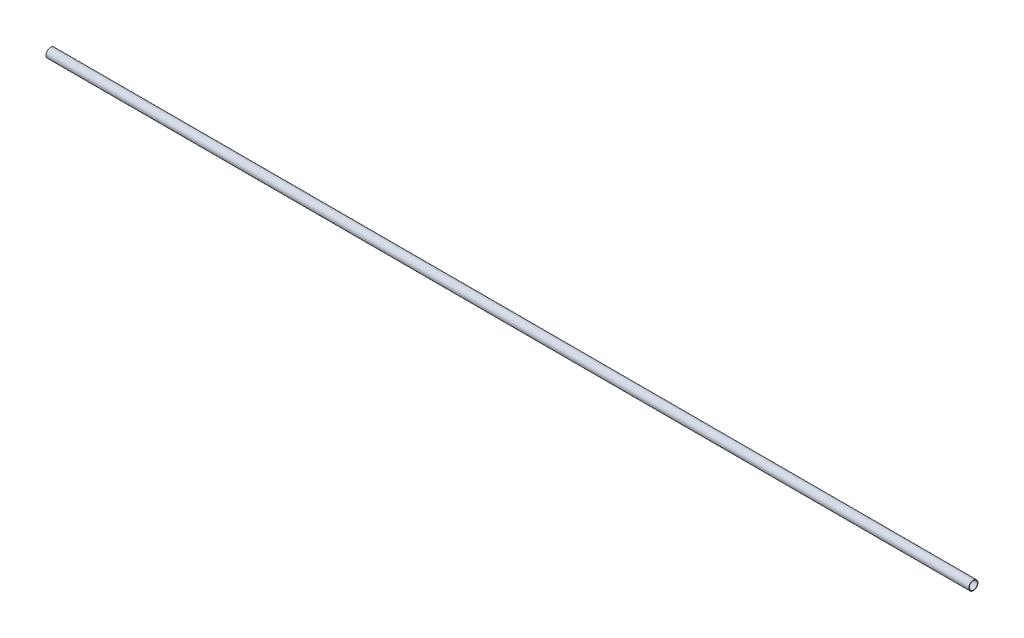
ISO-10303-21;
HEADER;
FILE_DESCRIPTION(('STEP AP214'),'2;1');
FILE_NAME('part.step','',(''),(''),'','','');
FILE_SCHEMA(('AUTOMOTIVE_DESIGN { 1 0 10303 214 1 1 1 1 }'));
ENDSEC;
DATA;
#1=APPLICATION_CONTEXT('core data for automotive mechanical design processes');
#2=APPLICATION_PROTOCOL_DEFINITION('international standard','automotive_design',2000,#1);
#3=PRODUCT_CONTEXT('',#1,'mechanical');
#4=PRODUCT('Part','Part','',(#3));
#5=PRODUCT_RELATED_PRODUCT_CATEGORY('part','',(#4));
#6=PRODUCT_DEFINITION_FORMATION('','',#4);
#7=PRODUCT_DEFINITION_CONTEXT('part definition',#1,'design');
#8=PRODUCT_DEFINITION('design','',#6,#7);
#9=PRODUCT_DEFINITION_SHAPE('','',#8);
#10=(LENGTH_UNIT() NAMED_UNIT(*) SI_UNIT(.MILLI.,.METRE.));
#11=(NAMED_UNIT(*) PLANE_ANGLE_UNIT() SI_UNIT($,.RADIAN.));
#12=(NAMED_UNIT(*) SI_UNIT($,.STERADIAN.) SOLID_ANGLE_UNIT());
#13=UNCERTAINTY_MEASURE_WITH_UNIT(LENGTH_MEASURE(1.E-05),#10,'distance_accuracy_value','');
#14=(GEOMETRIC_REPRESENTATION_CONTEXT(3) GLOBAL_UNCERTAINTY_ASSIGNED_CONTEXT((#13)) GLOBAL_UNIT_ASSIGNED_CONTEXT((#10,
#11,#12)) REPRESENTATION_CONTEXT('',''));
#15=CARTESIAN_POINT('',(0.,0.,0.));
#16=DIRECTION('',(0.,0.,1.));
#17=DIRECTION('',(1.,0.,0.));
#18=AXIS2_PLACEMENT_3D('',#15,#16,#17);
#19=CARTESIAN_POINT('',(0.,0.,0.));
#20=DIRECTION('',(1.,0.,0.));
#21=DIRECTION('',(0.,0.,-1.));
#22=AXIS2_PLACEMENT_3D('',#19,#20,#21);
#23=CYLINDRICAL_SURFACE('',#22,22.);
#24=CARTESIAN_POINT('',(0.,0.,0.));
#25=DIRECTION('',(1.,0.,0.));
#26=DIRECTION('',(0.,0.,-1.));
#27=AXIS2_PLACEMENT_3D('',#24,#25,#26);
#28=CIRCLE('',#27,22.);
#29=CARTESIAN_POINT('',(0.,0.,-22.));
#30=VERTEX_POINT('',#29);
#31=EDGE_CURVE('E16',#30,#30,#28,.T.);
#32=ORIENTED_EDGE('',*,*,#31,.F.);
#33=EDGE_LOOP('',(#32));
#34=FACE_BOUND('',#33,.T.);
#35=CARTESIAN_POINT('',(5000.,0.,0.));
#36=DIRECTION('',(1.,0.,0.));
#37=DIRECTION('',(0.,0.,-1.));
#38=AXIS2_PLACEMENT_3D('',#35,#36,#37);
#39=CIRCLE('',#38,22.);
#40=CARTESIAN_POINT('',(5000.,0.,-22.));
#41=VERTEX_POINT('',#40);
#42=EDGE_CURVE('E25',#41,#41,#39,.F.);
#43=ORIENTED_EDGE('',*,*,#42,.F.);
#44=EDGE_LOOP('',(#43));
#45=FACE_BOUND('',#44,.T.);
#46=ADVANCED_FACE('F13',(#34,#45),#23,.F.);
#47=CARTESIAN_POINT('',(0.,-25.3000021083535,-25.));
#48=DIRECTION('',(-1.,0.,0.));
#49=DIRECTION('',(0.,0.,1.));
#50=AXIS2_PLACEMENT_3D('',#47,#48,#49);
#51=PLANE('',#50);
#52=ORIENTED_EDGE('',*,*,#31,.T.);
#53=EDGE_LOOP('',(#52));
#54=FACE_BOUND('',#53,.T.);
#55=CARTESIAN_POINT('',(0.,0.,0.));
#56=DIRECTION('',(1.,0.,0.));
#57=DIRECTION('',(0.,0.,-1.));
#58=AXIS2_PLACEMENT_3D('',#55,#56,#57);
#59=CIRCLE('',#58,25.);
#60=CARTESIAN_POINT('',(0.,0.,-25.));
#61=VERTEX_POINT('',#60);
#62=EDGE_CURVE('E20',#61,#61,#59,.T.);
#63=ORIENTED_EDGE('',*,*,#62,.F.);
#64=EDGE_LOOP('',(#63));
#65=FACE_BOUND('',#64,.T.);
#66=ADVANCED_FACE('F33',(#54,#65),#51,.T.);
#67=CARTESIAN_POINT('',(5000.,-25.3000021083535,25.));
#68=DIRECTION('',(1.,0.,0.));
#69=DIRECTION('',(0.,0.,-1.));
#70=AXIS2_PLACEMENT_3D('',#67,#68,#69);
#71=PLANE('',#70);
#72=ORIENTED_EDGE('',*,*,#42,.T.);
#73=EDGE_LOOP('',(#72));
#74=FACE_BOUND('',#73,.T.);
#75=CARTESIAN_POINT('',(5000.,0.,0.));
#76=DIRECTION('',(1.,0.,0.));
#77=DIRECTION('',(0.,0.,-1.));
#78=AXIS2_PLACEMENT_3D('',#75,#76,#77);
#79=CIRCLE('',#78,25.);
#80=CARTESIAN_POINT('',(5000.,0.,-25.));
#81=VERTEX_POINT('',#80);
#82=EDGE_CURVE('E8',#81,#81,#79,.F.);
#83=ORIENTED_EDGE('',*,*,#82,.F.);
#84=EDGE_LOOP('',(#83));
#85=FACE_BOUND('',#84,.T.);
#86=ADVANCED_FACE('F42',(#74,#85),#71,.T.);
#87=CARTESIAN_POINT('',(5000.,0.,0.));
#88=DIRECTION('',(1.,0.,0.));
#89=DIRECTION('',(0.,0.,-1.));
#90=AXIS2_PLACEMENT_3D('',#87,#88,#89);
#91=CYLINDRICAL_SURFACE('',#90,25.);
#92=ORIENTED_EDGE('',*,*,#62,.T.);
#93=EDGE_LOOP('',(#92));
#94=FACE_BOUND('',#93,.T.);
#95=ORIENTED_EDGE('',*,*,#82,.T.);
#96=EDGE_LOOP('',(#95));
#97=FACE_BOUND('',#96,.T.);
#98=ADVANCED_FACE('F43',(#94,#97),#91,.T.);
#99=CLOSED_SHELL('',(#46,#66,#86,#98));
#100=MANIFOLD_SOLID_BREP('B1',#99);
#101=ADVANCED_BREP_SHAPE_REPRESENTATION('',(#18,#100),#14);
#102=SHAPE_DEFINITION_REPRESENTATION(#9,#101);
ENDSEC;
END-ISO-10303-21;
